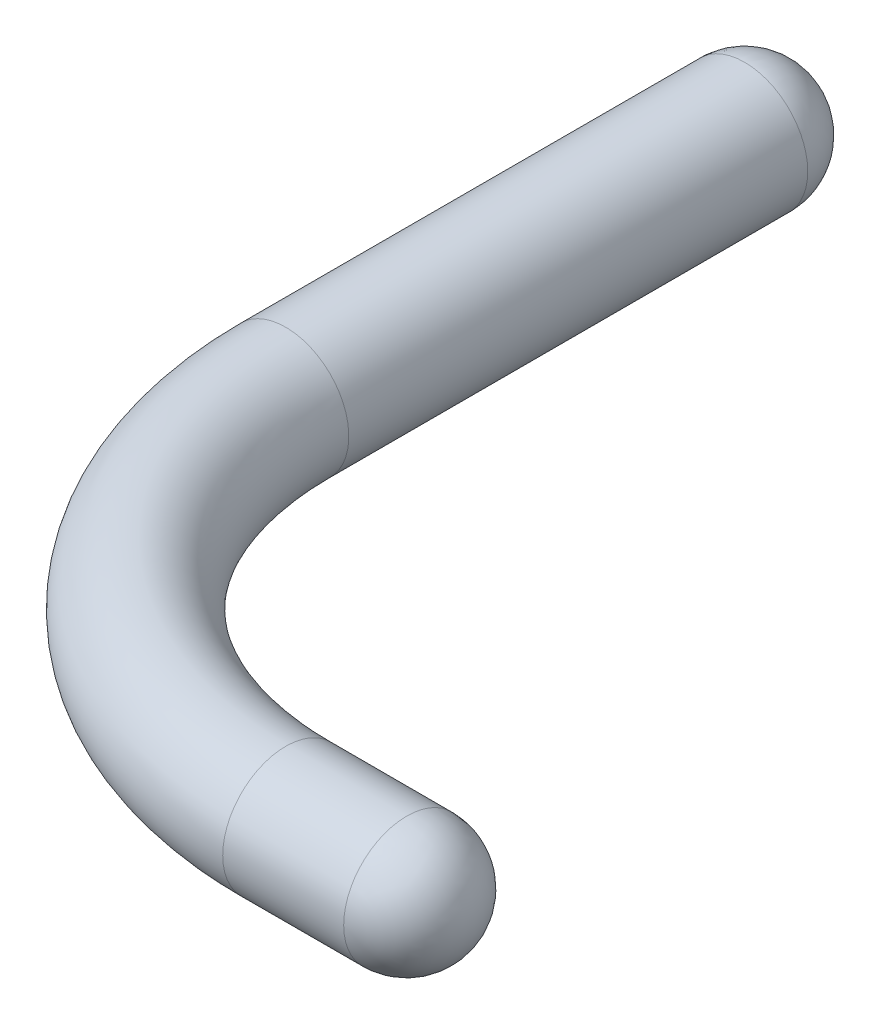
ISO-10303-21;
HEADER;
FILE_DESCRIPTION(('STEP AP214'),'2;1');
FILE_NAME('part.step','',(''),(''),'','','');
FILE_SCHEMA(('AUTOMOTIVE_DESIGN { 1 0 10303 214 1 1 1 1 }'));
ENDSEC;
DATA;
#1=APPLICATION_CONTEXT('core data for automotive mechanical design processes');
#2=APPLICATION_PROTOCOL_DEFINITION('international standard','automotive_design',2000,#1);
#3=PRODUCT_CONTEXT('',#1,'mechanical');
#4=PRODUCT('Part','Part','',(#3));
#5=PRODUCT_RELATED_PRODUCT_CATEGORY('part','',(#4));
#6=PRODUCT_DEFINITION_FORMATION('','',#4);
#7=PRODUCT_DEFINITION_CONTEXT('part definition',#1,'design');
#8=PRODUCT_DEFINITION('design','',#6,#7);
#9=PRODUCT_DEFINITION_SHAPE('','',#8);
#10=(LENGTH_UNIT() NAMED_UNIT(*) SI_UNIT(.MILLI.,.METRE.));
#11=(NAMED_UNIT(*) PLANE_ANGLE_UNIT() SI_UNIT($,.RADIAN.));
#12=(NAMED_UNIT(*) SI_UNIT($,.STERADIAN.) SOLID_ANGLE_UNIT());
#13=UNCERTAINTY_MEASURE_WITH_UNIT(LENGTH_MEASURE(1.E-05),#10,'distance_accuracy_value','');
#14=(GEOMETRIC_REPRESENTATION_CONTEXT(3) GLOBAL_UNCERTAINTY_ASSIGNED_CONTEXT((#13)) GLOBAL_UNIT_ASSIGNED_CONTEXT((#10,
#11,#12)) REPRESENTATION_CONTEXT('',''));
#15=CARTESIAN_POINT('',(0.,0.,0.));
#16=DIRECTION('',(0.,0.,1.));
#17=DIRECTION('',(1.,0.,0.));
#18=AXIS2_PLACEMENT_3D('',#15,#16,#17);
#19=CARTESIAN_POINT('',(10.16,0.,-3.));
#20=DIRECTION('',(1.,0.,0.));
#21=DIRECTION('',(0.,1.,0.));
#22=AXIS2_PLACEMENT_3D('',#19,#20,#21);
#23=SPHERICAL_SURFACE('',#22,0.331);
#24=CARTESIAN_POINT('',(10.16,0.,-3.));
#25=DIRECTION('',(0.,0.,1.));
#26=DIRECTION('',(1.,0.,0.));
#27=AXIS2_PLACEMENT_3D('',#24,#25,#26);
#28=CIRCLE('',#27,0.331);
#29=CARTESIAN_POINT('',(10.491,0.,-3.));
#30=VERTEX_POINT('',#29);
#31=CARTESIAN_POINT('',(9.829,0.,-3.));
#32=VERTEX_POINT('',#31);
#33=EDGE_CURVE('E44',#30,#32,#28,.T.);
#34=ORIENTED_EDGE('',*,*,#33,.F.);
#35=CARTESIAN_POINT('',(10.16,0.,-3.));
#36=DIRECTION('',(0.,0.,1.));
#37=DIRECTION('',(1.,0.,0.));
#38=AXIS2_PLACEMENT_3D('',#35,#36,#37);
#39=CIRCLE('',#38,0.331);
#40=EDGE_CURVE('E42',#32,#30,#39,.T.);
#41=ORIENTED_EDGE('',*,*,#40,.F.);
#42=EDGE_LOOP('',(#34,#41));
#43=FACE_BOUND('',#42,.T.);
#44=ADVANCED_FACE('F17',(#43),#23,.T.);
#45=CARTESIAN_POINT('',(12.7,0.,1.3142));
#46=DIRECTION('',(0.,0.,1.));
#47=DIRECTION('',(0.,1.,0.));
#48=AXIS2_PLACEMENT_3D('',#45,#46,#47);
#49=SPHERICAL_SURFACE('',#48,0.331);
#50=CARTESIAN_POINT('',(12.7,0.,1.3142));
#51=DIRECTION('',(1.,0.,0.));
#52=DIRECTION('',(0.,0.,-1.));
#53=AXIS2_PLACEMENT_3D('',#50,#51,#52);
#54=CIRCLE('',#53,0.331);
#55=CARTESIAN_POINT('',(12.7,0.,1.6452));
#56=VERTEX_POINT('',#55);
#57=CARTESIAN_POINT('',(12.7,0.,0.9832));
#58=VERTEX_POINT('',#57);
#59=EDGE_CURVE('E34',#56,#58,#54,.F.);
#60=ORIENTED_EDGE('',*,*,#59,.F.);
#61=CARTESIAN_POINT('',(12.7,0.,1.3142));
#62=DIRECTION('',(1.,0.,0.));
#63=DIRECTION('',(0.,0.,-1.));
#64=AXIS2_PLACEMENT_3D('',#61,#62,#63);
#65=CIRCLE('',#64,0.331);
#66=EDGE_CURVE('E47',#58,#56,#65,.F.);
#67=ORIENTED_EDGE('',*,*,#66,.F.);
#68=EDGE_LOOP('',(#60,#67));
#69=FACE_BOUND('',#68,.T.);
#70=ADVANCED_FACE('F54',(#69),#49,.T.);
#71=CARTESIAN_POINT('',(10.16,0.,-3.));
#72=DIRECTION('',(0.,0.,1.));
#73=DIRECTION('',(1.,0.,0.));
#74=AXIS2_PLACEMENT_3D('',#71,#72,#73);
#75=CYLINDRICAL_SURFACE('',#74,0.331);
#76=CARTESIAN_POINT('',(10.16,0.,-0.590800000000001));
#77=DIRECTION('',(0.,0.,1.));
#78=DIRECTION('',(-1.,0.,0.));
#79=AXIS2_PLACEMENT_3D('',#76,#77,#78);
#80=CIRCLE('',#79,0.331);
#81=CARTESIAN_POINT('',(9.829,0.,-0.590800000000001));
#82=VERTEX_POINT('',#81);
#83=EDGE_CURVE('E26',#82,#82,#80,.T.);
#84=ORIENTED_EDGE('',*,*,#83,.F.);
#85=EDGE_LOOP('',(#84));
#86=FACE_BOUND('',#85,.T.);
#87=ORIENTED_EDGE('',*,*,#40,.T.);
#88=ORIENTED_EDGE('',*,*,#33,.T.);
#89=EDGE_LOOP('',(#87,#88));
#90=FACE_BOUND('',#89,.T.);
#91=ADVANCED_FACE('F46',(#86,#90),#75,.T.);
#92=CARTESIAN_POINT('',(12.065,0.,1.3142));
#93=DIRECTION('',(1.,0.,0.));
#94=DIRECTION('',(0.,0.,-1.));
#95=AXIS2_PLACEMENT_3D('',#92,#93,#94);
#96=CYLINDRICAL_SURFACE('',#95,0.331);
#97=ORIENTED_EDGE('',*,*,#59,.T.);
#98=ORIENTED_EDGE('',*,*,#66,.T.);
#99=EDGE_LOOP('',(#97,#98));
#100=FACE_BOUND('',#99,.T.);
#101=CARTESIAN_POINT('',(12.065,0.,1.3142));
#102=DIRECTION('',(1.,0.,0.));
#103=DIRECTION('',(0.,0.,1.));
#104=AXIS2_PLACEMENT_3D('',#101,#102,#103);
#105=CIRCLE('',#104,0.331);
#106=CARTESIAN_POINT('',(12.065,0.,1.6452));
#107=VERTEX_POINT('',#106);
#108=EDGE_CURVE('E11',#107,#107,#105,.F.);
#109=ORIENTED_EDGE('',*,*,#108,.F.);
#110=EDGE_LOOP('',(#109));
#111=FACE_BOUND('',#110,.T.);
#112=ADVANCED_FACE('F59',(#100,#111),#96,.T.);
#113=CARTESIAN_POINT('',(12.065,0.,-0.5908));
#114=DIRECTION('',(0.,1.,0.));
#115=DIRECTION('',(0.,0.,1.));
#116=AXIS2_PLACEMENT_3D('',#113,#114,#115);
#117=TOROIDAL_SURFACE('',#116,1.905,0.331);
#118=ORIENTED_EDGE('',*,*,#108,.T.);
#119=EDGE_LOOP('',(#118));
#120=FACE_BOUND('',#119,.T.);
#121=ORIENTED_EDGE('',*,*,#83,.T.);
#122=EDGE_LOOP('',(#121));
#123=FACE_BOUND('',#122,.T.);
#124=ADVANCED_FACE('F63',(#120,#123),#117,.T.);
#125=CLOSED_SHELL('',(#44,#70,#91,#112,#124));
#126=MANIFOLD_SOLID_BREP('B1',#125);
#127=ADVANCED_BREP_SHAPE_REPRESENTATION('',(#18,#126),#14);
#128=SHAPE_DEFINITION_REPRESENTATION(#9,#127);
ENDSEC;
END-ISO-10303-21;
